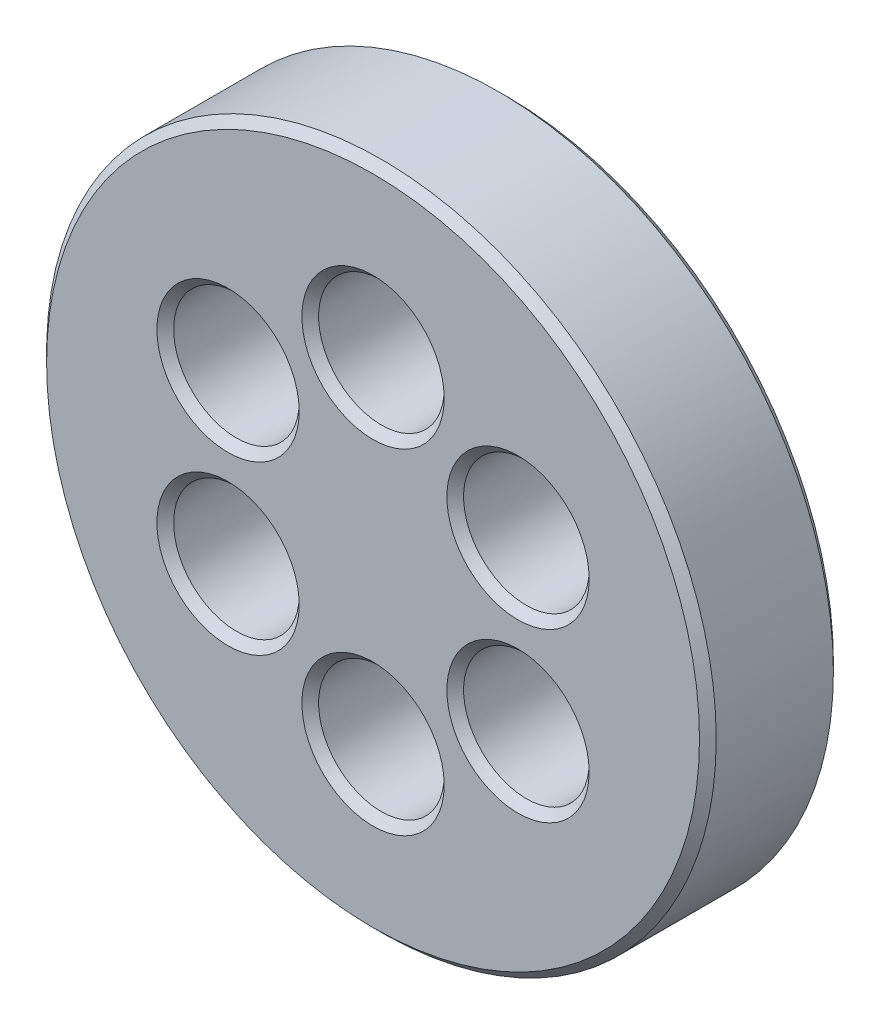
ISO-10303-21;
HEADER;
FILE_DESCRIPTION(('STEP AP214'),'2;1');
FILE_NAME('part.step','',(''),(''),'','','');
FILE_SCHEMA(('AUTOMOTIVE_DESIGN { 1 0 10303 214 1 1 1 1 }'));
ENDSEC;
DATA;
#1=APPLICATION_CONTEXT('core data for automotive mechanical design processes');
#2=APPLICATION_PROTOCOL_DEFINITION('international standard','automotive_design',2000,#1);
#3=PRODUCT_CONTEXT('',#1,'mechanical');
#4=PRODUCT('Part','Part','',(#3));
#5=PRODUCT_RELATED_PRODUCT_CATEGORY('part','',(#4));
#6=PRODUCT_DEFINITION_FORMATION('','',#4);
#7=PRODUCT_DEFINITION_CONTEXT('part definition',#1,'design');
#8=PRODUCT_DEFINITION('design','',#6,#7);
#9=PRODUCT_DEFINITION_SHAPE('','',#8);
#10=(LENGTH_UNIT() NAMED_UNIT(*) SI_UNIT(.MILLI.,.METRE.));
#11=(NAMED_UNIT(*) PLANE_ANGLE_UNIT() SI_UNIT($,.RADIAN.));
#12=(NAMED_UNIT(*) SI_UNIT($,.STERADIAN.) SOLID_ANGLE_UNIT());
#13=UNCERTAINTY_MEASURE_WITH_UNIT(LENGTH_MEASURE(1.E-05),#10,'distance_accuracy_value','');
#14=(GEOMETRIC_REPRESENTATION_CONTEXT(3) GLOBAL_UNCERTAINTY_ASSIGNED_CONTEXT((#13)) GLOBAL_UNIT_ASSIGNED_CONTEXT((#10,
#11,#12)) REPRESENTATION_CONTEXT('',''));
#15=CARTESIAN_POINT('',(0.,0.,0.));
#16=DIRECTION('',(0.,0.,1.));
#17=DIRECTION('',(1.,0.,0.));
#18=AXIS2_PLACEMENT_3D('',#15,#16,#17);
#19=CARTESIAN_POINT('',(0.,0.,8.));
#20=DIRECTION('',(0.,0.,-1.));
#21=DIRECTION('',(-1.,0.,0.));
#22=AXIS2_PLACEMENT_3D('',#19,#20,#21);
#23=CYLINDRICAL_SURFACE('',#22,20.);
#24=CARTESIAN_POINT('',(0.,0.,0.499999999999997));
#25=DIRECTION('',(0.,0.,1.));
#26=DIRECTION('',(1.,0.,0.));
#27=AXIS2_PLACEMENT_3D('',#24,#25,#26);
#28=CIRCLE('',#27,20.);
#29=CARTESIAN_POINT('',(20.,0.,0.499999999999997));
#30=VERTEX_POINT('',#29);
#31=EDGE_CURVE('E10',#30,#30,#28,.T.);
#32=ORIENTED_EDGE('',*,*,#31,.T.);
#33=EDGE_LOOP('',(#32));
#34=FACE_BOUND('',#33,.T.);
#35=CARTESIAN_POINT('',(0.,0.,7.49999999999999));
#36=DIRECTION('',(0.,0.,1.));
#37=DIRECTION('',(1.,0.,0.));
#38=AXIS2_PLACEMENT_3D('',#35,#36,#37);
#39=CIRCLE('',#38,20.);
#40=CARTESIAN_POINT('',(20.,0.,7.49999999999999));
#41=VERTEX_POINT('',#40);
#42=EDGE_CURVE('E44',#41,#41,#39,.F.);
#43=ORIENTED_EDGE('',*,*,#42,.T.);
#44=EDGE_LOOP('',(#43));
#45=FACE_BOUND('',#44,.T.);
#46=ADVANCED_FACE('F36',(#34,#45),#23,.T.);
#47=CARTESIAN_POINT('',(0.,0.,8.));
#48=DIRECTION('',(0.,0.,1.));
#49=DIRECTION('',(1.,0.,0.));
#50=AXIS2_PLACEMENT_3D('',#47,#48,#49);
#51=PLANE('',#50);
#52=CARTESIAN_POINT('',(-8.66025403784443,-4.99999999999992,8.));
#53=DIRECTION('',(0.,0.,1.));
#54=DIRECTION('',(1.,0.,0.));
#55=AXIS2_PLACEMENT_3D('',#52,#53,#54);
#56=CIRCLE('',#55,4.25000000000001);
#57=CARTESIAN_POINT('',(-4.41025403784443,-4.99999999999992,8.));
#58=VERTEX_POINT('',#57);
#59=EDGE_CURVE('E102',#58,#58,#56,.F.);
#60=ORIENTED_EDGE('',*,*,#59,.T.);
#61=EDGE_LOOP('',(#60));
#62=FACE_BOUND('',#61,.T.);
#63=CARTESIAN_POINT('',(0.,-10.,8.));
#64=DIRECTION('',(0.,0.,1.));
#65=DIRECTION('',(1.,0.,0.));
#66=AXIS2_PLACEMENT_3D('',#63,#64,#65);
#67=CIRCLE('',#66,4.25);
#68=CARTESIAN_POINT('',(4.25,-10.,8.));
#69=VERTEX_POINT('',#68);
#70=EDGE_CURVE('E105',#69,#69,#67,.F.);
#71=ORIENTED_EDGE('',*,*,#70,.T.);
#72=EDGE_LOOP('',(#71));
#73=FACE_BOUND('',#72,.T.);
#74=CARTESIAN_POINT('',(8.66025403784437,-5.00000000000004,8.));
#75=DIRECTION('',(0.,0.,1.));
#76=DIRECTION('',(1.,0.,0.));
#77=AXIS2_PLACEMENT_3D('',#74,#75,#76);
#78=CIRCLE('',#77,4.25);
#79=CARTESIAN_POINT('',(12.9102540378444,-5.00000000000004,8.));
#80=VERTEX_POINT('',#79);
#81=EDGE_CURVE('E108',#80,#80,#78,.F.);
#82=ORIENTED_EDGE('',*,*,#81,.T.);
#83=EDGE_LOOP('',(#82));
#84=FACE_BOUND('',#83,.T.);
#85=CARTESIAN_POINT('',(8.6602540378444,4.99999999999998,8.));
#86=DIRECTION('',(0.,0.,1.));
#87=DIRECTION('',(1.,0.,0.));
#88=AXIS2_PLACEMENT_3D('',#85,#86,#87);
#89=CIRCLE('',#88,4.25000000000001);
#90=CARTESIAN_POINT('',(12.9102540378444,4.99999999999998,8.));
#91=VERTEX_POINT('',#90);
#92=EDGE_CURVE('E111',#91,#91,#89,.F.);
#93=ORIENTED_EDGE('',*,*,#92,.T.);
#94=EDGE_LOOP('',(#93));
#95=FACE_BOUND('',#94,.T.);
#96=CARTESIAN_POINT('',(0.,10.,8.));
#97=DIRECTION('',(0.,0.,1.));
#98=DIRECTION('',(1.,0.,0.));
#99=AXIS2_PLACEMENT_3D('',#96,#97,#98);
#100=CIRCLE('',#99,4.25);
#101=CARTESIAN_POINT('',(4.25,10.,8.));
#102=VERTEX_POINT('',#101);
#103=EDGE_CURVE('E114',#102,#102,#100,.F.);
#104=ORIENTED_EDGE('',*,*,#103,.T.);
#105=EDGE_LOOP('',(#104));
#106=FACE_BOUND('',#105,.T.);
#107=CARTESIAN_POINT('',(-8.66025403784433,5.0000000000001,8.));
#108=DIRECTION('',(0.,0.,1.));
#109=DIRECTION('',(1.,0.,0.));
#110=AXIS2_PLACEMENT_3D('',#107,#108,#109);
#111=CIRCLE('',#110,4.25);
#112=CARTESIAN_POINT('',(-4.41025403784433,5.0000000000001,8.));
#113=VERTEX_POINT('',#112);
#114=EDGE_CURVE('E117',#113,#113,#111,.F.);
#115=ORIENTED_EDGE('',*,*,#114,.T.);
#116=EDGE_LOOP('',(#115));
#117=FACE_BOUND('',#116,.T.);
#118=CARTESIAN_POINT('',(0.,0.,8.));
#119=DIRECTION('',(0.,0.,1.));
#120=DIRECTION('',(1.,0.,0.));
#121=AXIS2_PLACEMENT_3D('',#118,#119,#120);
#122=CIRCLE('',#121,19.5);
#123=CARTESIAN_POINT('',(19.5,0.,8.));
#124=VERTEX_POINT('',#123);
#125=EDGE_CURVE('E120',#124,#124,#122,.T.);
#126=ORIENTED_EDGE('',*,*,#125,.T.);
#127=EDGE_LOOP('',(#126));
#128=FACE_BOUND('',#127,.T.);
#129=ADVANCED_FACE('F144',(#62,#73,#84,#95,#106,#117,#128),#51,.T.);
#130=CARTESIAN_POINT('',(0.,0.,0.));
#131=DIRECTION('',(0.,0.,1.));
#132=DIRECTION('',(1.,0.,0.));
#133=AXIS2_PLACEMENT_3D('',#130,#131,#132);
#134=PLANE('',#133);
#135=CARTESIAN_POINT('',(-8.66025403784443,-4.99999999999992,0.));
#136=DIRECTION('',(0.,0.,1.));
#137=DIRECTION('',(1.,0.,0.));
#138=AXIS2_PLACEMENT_3D('',#135,#136,#137);
#139=CIRCLE('',#138,4.25);
#140=CARTESIAN_POINT('',(-4.41025403784443,-4.99999999999992,0.));
#141=VERTEX_POINT('',#140);
#142=EDGE_CURVE('E81',#141,#141,#139,.T.);
#143=ORIENTED_EDGE('',*,*,#142,.T.);
#144=EDGE_LOOP('',(#143));
#145=FACE_BOUND('',#144,.T.);
#146=CARTESIAN_POINT('',(0.,-10.,0.));
#147=DIRECTION('',(0.,0.,1.));
#148=DIRECTION('',(1.,0.,0.));
#149=AXIS2_PLACEMENT_3D('',#146,#147,#148);
#150=CIRCLE('',#149,4.24999999999999);
#151=CARTESIAN_POINT('',(4.24999999999999,-10.,0.));
#152=VERTEX_POINT('',#151);
#153=EDGE_CURVE('E84',#152,#152,#150,.T.);
#154=ORIENTED_EDGE('',*,*,#153,.T.);
#155=EDGE_LOOP('',(#154));
#156=FACE_BOUND('',#155,.T.);
#157=CARTESIAN_POINT('',(8.66025403784437,-5.00000000000004,0.));
#158=DIRECTION('',(0.,0.,1.));
#159=DIRECTION('',(1.,0.,0.));
#160=AXIS2_PLACEMENT_3D('',#157,#158,#159);
#161=CIRCLE('',#160,4.25);
#162=CARTESIAN_POINT('',(12.9102540378444,-5.00000000000004,0.));
#163=VERTEX_POINT('',#162);
#164=EDGE_CURVE('E87',#163,#163,#161,.T.);
#165=ORIENTED_EDGE('',*,*,#164,.T.);
#166=EDGE_LOOP('',(#165));
#167=FACE_BOUND('',#166,.T.);
#168=CARTESIAN_POINT('',(8.6602540378444,4.99999999999998,0.));
#169=DIRECTION('',(0.,0.,1.));
#170=DIRECTION('',(1.,0.,0.));
#171=AXIS2_PLACEMENT_3D('',#168,#169,#170);
#172=CIRCLE('',#171,4.24999999999999);
#173=CARTESIAN_POINT('',(12.9102540378444,4.99999999999998,0.));
#174=VERTEX_POINT('',#173);
#175=EDGE_CURVE('E90',#174,#174,#172,.T.);
#176=ORIENTED_EDGE('',*,*,#175,.T.);
#177=EDGE_LOOP('',(#176));
#178=FACE_BOUND('',#177,.T.);
#179=CARTESIAN_POINT('',(0.,10.,0.));
#180=DIRECTION('',(0.,0.,1.));
#181=DIRECTION('',(1.,0.,0.));
#182=AXIS2_PLACEMENT_3D('',#179,#180,#181);
#183=CIRCLE('',#182,4.24999999999999);
#184=CARTESIAN_POINT('',(4.24999999999999,10.,0.));
#185=VERTEX_POINT('',#184);
#186=EDGE_CURVE('E93',#185,#185,#183,.T.);
#187=ORIENTED_EDGE('',*,*,#186,.T.);
#188=EDGE_LOOP('',(#187));
#189=FACE_BOUND('',#188,.T.);
#190=CARTESIAN_POINT('',(-8.66025403784433,5.0000000000001,0.));
#191=DIRECTION('',(0.,0.,1.));
#192=DIRECTION('',(1.,0.,0.));
#193=AXIS2_PLACEMENT_3D('',#190,#191,#192);
#194=CIRCLE('',#193,4.25);
#195=CARTESIAN_POINT('',(-4.41025403784433,5.0000000000001,0.));
#196=VERTEX_POINT('',#195);
#197=EDGE_CURVE('E96',#196,#196,#194,.T.);
#198=ORIENTED_EDGE('',*,*,#197,.T.);
#199=EDGE_LOOP('',(#198));
#200=FACE_BOUND('',#199,.T.);
#201=CARTESIAN_POINT('',(0.,0.,0.));
#202=DIRECTION('',(0.,0.,1.));
#203=DIRECTION('',(1.,0.,0.));
#204=AXIS2_PLACEMENT_3D('',#201,#202,#203);
#205=CIRCLE('',#204,19.5);
#206=CARTESIAN_POINT('',(19.5,0.,0.));
#207=VERTEX_POINT('',#206);
#208=EDGE_CURVE('E99',#207,#207,#205,.F.);
#209=ORIENTED_EDGE('',*,*,#208,.T.);
#210=EDGE_LOOP('',(#209));
#211=FACE_BOUND('',#210,.T.);
#212=ADVANCED_FACE('F140',(#145,#156,#167,#178,#189,#200,#211),#134,.F.);
#213=CARTESIAN_POINT('',(0.,10.,0.));
#214=DIRECTION('',(0.,0.,1.));
#215=DIRECTION('',(1.,0.,0.));
#216=AXIS2_PLACEMENT_3D('',#213,#214,#215);
#217=CYLINDRICAL_SURFACE('',#216,3.75);
#218=CARTESIAN_POINT('',(0.,10.,7.5));
#219=DIRECTION('',(0.,0.,1.));
#220=DIRECTION('',(1.,0.,0.));
#221=AXIS2_PLACEMENT_3D('',#218,#219,#220);
#222=CIRCLE('',#221,3.75);
#223=CARTESIAN_POINT('',(3.75,10.,7.5));
#224=VERTEX_POINT('',#223);
#225=EDGE_CURVE('E57',#224,#224,#222,.T.);
#226=ORIENTED_EDGE('',*,*,#225,.T.);
#227=EDGE_LOOP('',(#226));
#228=FACE_BOUND('',#227,.T.);
#229=CARTESIAN_POINT('',(0.,10.,0.499999999999994));
#230=DIRECTION('',(0.,0.,1.));
#231=DIRECTION('',(1.,0.,0.));
#232=AXIS2_PLACEMENT_3D('',#229,#230,#231);
#233=CIRCLE('',#232,3.75);
#234=CARTESIAN_POINT('',(3.75,10.,0.499999999999994));
#235=VERTEX_POINT('',#234);
#236=EDGE_CURVE('E60',#235,#235,#233,.F.);
#237=ORIENTED_EDGE('',*,*,#236,.T.);
#238=EDGE_LOOP('',(#237));
#239=FACE_BOUND('',#238,.T.);
#240=ADVANCED_FACE('F143',(#228,#239),#217,.F.);
#241=CARTESIAN_POINT('',(8.6602540378444,4.99999999999998,0.));
#242=DIRECTION('',(0.,0.,1.));
#243=DIRECTION('',(1.,0.,0.));
#244=AXIS2_PLACEMENT_3D('',#241,#242,#243);
#245=CYLINDRICAL_SURFACE('',#244,3.75);
#246=CARTESIAN_POINT('',(8.6602540378444,4.99999999999998,7.49999999999999));
#247=DIRECTION('',(0.,0.,1.));
#248=DIRECTION('',(1.,0.,0.));
#249=AXIS2_PLACEMENT_3D('',#246,#247,#248);
#250=CIRCLE('',#249,3.75);
#251=CARTESIAN_POINT('',(12.4102540378444,4.99999999999998,7.49999999999999));
#252=VERTEX_POINT('',#251);
#253=EDGE_CURVE('E63',#252,#252,#250,.T.);
#254=ORIENTED_EDGE('',*,*,#253,.T.);
#255=EDGE_LOOP('',(#254));
#256=FACE_BOUND('',#255,.T.);
#257=CARTESIAN_POINT('',(8.6602540378444,4.99999999999998,0.500000000000002));
#258=DIRECTION('',(0.,0.,1.));
#259=DIRECTION('',(1.,0.,0.));
#260=AXIS2_PLACEMENT_3D('',#257,#258,#259);
#261=CIRCLE('',#260,3.75);
#262=CARTESIAN_POINT('',(12.4102540378444,4.99999999999998,0.500000000000002));
#263=VERTEX_POINT('',#262);
#264=EDGE_CURVE('E66',#263,#263,#261,.F.);
#265=ORIENTED_EDGE('',*,*,#264,.T.);
#266=EDGE_LOOP('',(#265));
#267=FACE_BOUND('',#266,.T.);
#268=ADVANCED_FACE('F275',(#256,#267),#245,.F.);
#269=CARTESIAN_POINT('',(8.66025403784437,-5.00000000000004,0.));
#270=DIRECTION('',(0.,0.,1.));
#271=DIRECTION('',(1.,0.,0.));
#272=AXIS2_PLACEMENT_3D('',#269,#270,#271);
#273=CYLINDRICAL_SURFACE('',#272,3.75);
#274=CARTESIAN_POINT('',(8.66025403784437,-5.00000000000004,7.5));
#275=DIRECTION('',(0.,0.,1.));
#276=DIRECTION('',(1.,0.,0.));
#277=AXIS2_PLACEMENT_3D('',#274,#275,#276);
#278=CIRCLE('',#277,3.75);
#279=CARTESIAN_POINT('',(12.4102540378444,-5.00000000000004,7.5));
#280=VERTEX_POINT('',#279);
#281=EDGE_CURVE('E69',#280,#280,#278,.T.);
#282=ORIENTED_EDGE('',*,*,#281,.T.);
#283=EDGE_LOOP('',(#282));
#284=FACE_BOUND('',#283,.T.);
#285=CARTESIAN_POINT('',(8.66025403784437,-5.00000000000004,0.499999999999993));
#286=DIRECTION('',(0.,0.,1.));
#287=DIRECTION('',(1.,0.,0.));
#288=AXIS2_PLACEMENT_3D('',#285,#286,#287);
#289=CIRCLE('',#288,3.75);
#290=CARTESIAN_POINT('',(12.4102540378444,-5.00000000000004,0.499999999999993));
#291=VERTEX_POINT('',#290);
#292=EDGE_CURVE('E72',#291,#291,#289,.F.);
#293=ORIENTED_EDGE('',*,*,#292,.T.);
#294=EDGE_LOOP('',(#293));
#295=FACE_BOUND('',#294,.T.);
#296=ADVANCED_FACE('F278',(#284,#295),#273,.F.);
#297=CARTESIAN_POINT('',(0.,-10.,0.));
#298=DIRECTION('',(0.,0.,1.));
#299=DIRECTION('',(1.,0.,0.));
#300=AXIS2_PLACEMENT_3D('',#297,#298,#299);
#301=CYLINDRICAL_SURFACE('',#300,3.75);
#302=CARTESIAN_POINT('',(0.,-10.,7.5));
#303=DIRECTION('',(0.,0.,1.));
#304=DIRECTION('',(1.,0.,0.));
#305=AXIS2_PLACEMENT_3D('',#302,#303,#304);
#306=CIRCLE('',#305,3.75);
#307=CARTESIAN_POINT('',(3.75,-10.,7.5));
#308=VERTEX_POINT('',#307);
#309=EDGE_CURVE('E75',#308,#308,#306,.T.);
#310=ORIENTED_EDGE('',*,*,#309,.T.);
#311=EDGE_LOOP('',(#310));
#312=FACE_BOUND('',#311,.T.);
#313=CARTESIAN_POINT('',(0.,-10.,0.499999999999994));
#314=DIRECTION('',(0.,0.,1.));
#315=DIRECTION('',(1.,0.,0.));
#316=AXIS2_PLACEMENT_3D('',#313,#314,#315);
#317=CIRCLE('',#316,3.75);
#318=CARTESIAN_POINT('',(3.75,-10.,0.499999999999994));
#319=VERTEX_POINT('',#318);
#320=EDGE_CURVE('E78',#319,#319,#317,.F.);
#321=ORIENTED_EDGE('',*,*,#320,.T.);
#322=EDGE_LOOP('',(#321));
#323=FACE_BOUND('',#322,.T.);
#324=ADVANCED_FACE('F270',(#312,#323),#301,.F.);
#325=CARTESIAN_POINT('',(-8.66025403784443,-4.99999999999992,0.));
#326=DIRECTION('',(0.,0.,1.));
#327=DIRECTION('',(1.,0.,0.));
#328=AXIS2_PLACEMENT_3D('',#325,#326,#327);
#329=CYLINDRICAL_SURFACE('',#328,3.75);
#330=CARTESIAN_POINT('',(-8.66025403784443,-4.99999999999992,7.5));
#331=DIRECTION('',(0.,0.,1.));
#332=DIRECTION('',(1.,0.,0.));
#333=AXIS2_PLACEMENT_3D('',#330,#331,#332);
#334=CIRCLE('',#333,3.75);
#335=CARTESIAN_POINT('',(-4.91025403784443,-4.99999999999992,7.5));
#336=VERTEX_POINT('',#335);
#337=EDGE_CURVE('E123',#336,#336,#334,.T.);
#338=ORIENTED_EDGE('',*,*,#337,.T.);
#339=EDGE_LOOP('',(#338));
#340=FACE_BOUND('',#339,.T.);
#341=CARTESIAN_POINT('',(-8.66025403784443,-4.99999999999992,0.5));
#342=DIRECTION('',(0.,0.,1.));
#343=DIRECTION('',(1.,0.,0.));
#344=AXIS2_PLACEMENT_3D('',#341,#342,#343);
#345=CIRCLE('',#344,3.75);
#346=CARTESIAN_POINT('',(-4.91025403784443,-4.99999999999992,0.5));
#347=VERTEX_POINT('',#346);
#348=EDGE_CURVE('E126',#347,#347,#345,.F.);
#349=ORIENTED_EDGE('',*,*,#348,.T.);
#350=EDGE_LOOP('',(#349));
#351=FACE_BOUND('',#350,.T.);
#352=ADVANCED_FACE('F130',(#340,#351),#329,.F.);
#353=CARTESIAN_POINT('',(-8.66025403784433,5.0000000000001,0.));
#354=DIRECTION('',(0.,0.,1.));
#355=DIRECTION('',(1.,0.,0.));
#356=AXIS2_PLACEMENT_3D('',#353,#354,#355);
#357=CYLINDRICAL_SURFACE('',#356,3.75);
#358=CARTESIAN_POINT('',(-8.66025403784433,5.0000000000001,7.5));
#359=DIRECTION('',(0.,0.,1.));
#360=DIRECTION('',(1.,0.,0.));
#361=AXIS2_PLACEMENT_3D('',#358,#359,#360);
#362=CIRCLE('',#361,3.75);
#363=CARTESIAN_POINT('',(-4.91025403784433,5.0000000000001,7.5));
#364=VERTEX_POINT('',#363);
#365=EDGE_CURVE('E48',#364,#364,#362,.T.);
#366=ORIENTED_EDGE('',*,*,#365,.T.);
#367=EDGE_LOOP('',(#366));
#368=FACE_BOUND('',#367,.T.);
#369=CARTESIAN_POINT('',(-8.66025403784433,5.0000000000001,0.500000000000002));
#370=DIRECTION('',(0.,0.,1.));
#371=DIRECTION('',(1.,0.,0.));
#372=AXIS2_PLACEMENT_3D('',#369,#370,#371);
#373=CIRCLE('',#372,3.75);
#374=CARTESIAN_POINT('',(-4.91025403784433,5.0000000000001,0.500000000000002));
#375=VERTEX_POINT('',#374);
#376=EDGE_CURVE('E52',#375,#375,#373,.F.);
#377=ORIENTED_EDGE('',*,*,#376,.T.);
#378=EDGE_LOOP('',(#377));
#379=FACE_BOUND('',#378,.T.);
#380=ADVANCED_FACE('F184',(#368,#379),#357,.F.);
#381=CARTESIAN_POINT('',(-8.66025403784443,-4.99999999999992,7.5));
#382=DIRECTION('',(0.,0.,1.));
#383=DIRECTION('',(1.,0.,0.));
#384=AXIS2_PLACEMENT_3D('',#381,#382,#383);
#385=CONICAL_SURFACE('',#384,3.75,0.78539816339745);
#386=ORIENTED_EDGE('',*,*,#59,.F.);
#387=EDGE_LOOP('',(#386));
#388=FACE_BOUND('',#387,.T.);
#389=ORIENTED_EDGE('',*,*,#337,.F.);
#390=EDGE_LOOP('',(#389));
#391=FACE_BOUND('',#390,.T.);
#392=ADVANCED_FACE('F136',(#388,#391),#385,.F.);
#393=CARTESIAN_POINT('',(-8.66025403784443,-4.99999999999992,0.));
#394=DIRECTION('',(0.,0.,-1.));
#395=DIRECTION('',(-1.,0.,0.));
#396=AXIS2_PLACEMENT_3D('',#393,#394,#395);
#397=CONICAL_SURFACE('',#396,4.25,0.785398163397447);
#398=ORIENTED_EDGE('',*,*,#348,.F.);
#399=EDGE_LOOP('',(#398));
#400=FACE_BOUND('',#399,.T.);
#401=ORIENTED_EDGE('',*,*,#142,.F.);
#402=EDGE_LOOP('',(#401));
#403=FACE_BOUND('',#402,.T.);
#404=ADVANCED_FACE('F132',(#400,#403),#397,.F.);
#405=CARTESIAN_POINT('',(0.,-10.,7.5));
#406=DIRECTION('',(0.,0.,1.));
#407=DIRECTION('',(1.,0.,0.));
#408=AXIS2_PLACEMENT_3D('',#405,#406,#407);
#409=CONICAL_SURFACE('',#408,3.75,0.785398163397448);
#410=ORIENTED_EDGE('',*,*,#70,.F.);
#411=EDGE_LOOP('',(#410));
#412=FACE_BOUND('',#411,.T.);
#413=ORIENTED_EDGE('',*,*,#309,.F.);
#414=EDGE_LOOP('',(#413));
#415=FACE_BOUND('',#414,.T.);
#416=ADVANCED_FACE('F135',(#412,#415),#409,.F.);
#417=CARTESIAN_POINT('',(0.,-10.,0.));
#418=DIRECTION('',(0.,0.,-1.));
#419=DIRECTION('',(-1.,0.,0.));
#420=AXIS2_PLACEMENT_3D('',#417,#418,#419);
#421=CONICAL_SURFACE('',#420,4.24999999999999,0.785398163397445);
#422=ORIENTED_EDGE('',*,*,#320,.F.);
#423=EDGE_LOOP('',(#422));
#424=FACE_BOUND('',#423,.T.);
#425=ORIENTED_EDGE('',*,*,#153,.F.);
#426=EDGE_LOOP('',(#425));
#427=FACE_BOUND('',#426,.T.);
#428=ADVANCED_FACE('F195',(#424,#427),#421,.F.);
#429=CARTESIAN_POINT('',(8.66025403784437,-5.00000000000004,7.5));
#430=DIRECTION('',(0.,0.,1.));
#431=DIRECTION('',(1.,0.,0.));
#432=AXIS2_PLACEMENT_3D('',#429,#430,#431);
#433=CONICAL_SURFACE('',#432,3.75,0.78539816339744);
#434=ORIENTED_EDGE('',*,*,#81,.F.);
#435=EDGE_LOOP('',(#434));
#436=FACE_BOUND('',#435,.T.);
#437=ORIENTED_EDGE('',*,*,#281,.F.);
#438=EDGE_LOOP('',(#437));
#439=FACE_BOUND('',#438,.T.);
#440=ADVANCED_FACE('F202',(#436,#439),#433,.F.);
#441=CARTESIAN_POINT('',(8.66025403784437,-5.00000000000004,0.));
#442=DIRECTION('',(0.,0.,-1.));
#443=DIRECTION('',(-1.,0.,0.));
#444=AXIS2_PLACEMENT_3D('',#441,#442,#443);
#445=CONICAL_SURFACE('',#444,4.25,0.785398163397452);
#446=ORIENTED_EDGE('',*,*,#292,.F.);
#447=EDGE_LOOP('',(#446));
#448=FACE_BOUND('',#447,.T.);
#449=ORIENTED_EDGE('',*,*,#164,.F.);
#450=EDGE_LOOP('',(#449));
#451=FACE_BOUND('',#450,.T.);
#452=ADVANCED_FACE('F209',(#448,#451),#445,.F.);
#453=CARTESIAN_POINT('',(8.6602540378444,4.99999999999998,7.49999999999999));
#454=DIRECTION('',(0.,0.,1.));
#455=DIRECTION('',(1.,0.,0.));
#456=AXIS2_PLACEMENT_3D('',#453,#454,#455);
#457=CONICAL_SURFACE('',#456,3.75,0.785398163397451);
#458=ORIENTED_EDGE('',*,*,#92,.F.);
#459=EDGE_LOOP('',(#458));
#460=FACE_BOUND('',#459,.T.);
#461=ORIENTED_EDGE('',*,*,#253,.F.);
#462=EDGE_LOOP('',(#461));
#463=FACE_BOUND('',#462,.T.);
#464=ADVANCED_FACE('F216',(#460,#463),#457,.F.);
#465=CARTESIAN_POINT('',(8.6602540378444,4.99999999999998,0.));
#466=DIRECTION('',(0.,0.,-1.));
#467=DIRECTION('',(-1.,0.,0.));
#468=AXIS2_PLACEMENT_3D('',#465,#466,#467);
#469=CONICAL_SURFACE('',#468,4.24999999999999,0.785398163397441);
#470=ORIENTED_EDGE('',*,*,#264,.F.);
#471=EDGE_LOOP('',(#470));
#472=FACE_BOUND('',#471,.T.);
#473=ORIENTED_EDGE('',*,*,#175,.F.);
#474=EDGE_LOOP('',(#473));
#475=FACE_BOUND('',#474,.T.);
#476=ADVANCED_FACE('F223',(#472,#475),#469,.F.);
#477=CARTESIAN_POINT('',(0.,10.,7.5));
#478=DIRECTION('',(0.,0.,1.));
#479=DIRECTION('',(1.,0.,0.));
#480=AXIS2_PLACEMENT_3D('',#477,#478,#479);
#481=CONICAL_SURFACE('',#480,3.75,0.785398163397448);
#482=ORIENTED_EDGE('',*,*,#103,.F.);
#483=EDGE_LOOP('',(#482));
#484=FACE_BOUND('',#483,.T.);
#485=ORIENTED_EDGE('',*,*,#225,.F.);
#486=EDGE_LOOP('',(#485));
#487=FACE_BOUND('',#486,.T.);
#488=ADVANCED_FACE('F230',(#484,#487),#481,.F.);
#489=CARTESIAN_POINT('',(0.,10.,0.));
#490=DIRECTION('',(0.,0.,-1.));
#491=DIRECTION('',(-1.,0.,0.));
#492=AXIS2_PLACEMENT_3D('',#489,#490,#491);
#493=CONICAL_SURFACE('',#492,4.24999999999999,0.785398163397445);
#494=ORIENTED_EDGE('',*,*,#236,.F.);
#495=EDGE_LOOP('',(#494));
#496=FACE_BOUND('',#495,.T.);
#497=ORIENTED_EDGE('',*,*,#186,.F.);
#498=EDGE_LOOP('',(#497));
#499=FACE_BOUND('',#498,.T.);
#500=ADVANCED_FACE('F237',(#496,#499),#493,.F.);
#501=CARTESIAN_POINT('',(-8.66025403784433,5.0000000000001,7.5));
#502=DIRECTION('',(0.,0.,1.));
#503=DIRECTION('',(1.,0.,0.));
#504=AXIS2_PLACEMENT_3D('',#501,#502,#503);
#505=CONICAL_SURFACE('',#504,3.75,0.785398163397449);
#506=ORIENTED_EDGE('',*,*,#114,.F.);
#507=EDGE_LOOP('',(#506));
#508=FACE_BOUND('',#507,.T.);
#509=ORIENTED_EDGE('',*,*,#365,.F.);
#510=EDGE_LOOP('',(#509));
#511=FACE_BOUND('',#510,.T.);
#512=ADVANCED_FACE('F167',(#508,#511),#505,.F.);
#513=CARTESIAN_POINT('',(-8.66025403784433,5.0000000000001,0.));
#514=DIRECTION('',(0.,0.,-1.));
#515=DIRECTION('',(-1.,0.,0.));
#516=AXIS2_PLACEMENT_3D('',#513,#514,#515);
#517=CONICAL_SURFACE('',#516,4.25,0.785398163397445);
#518=ORIENTED_EDGE('',*,*,#376,.F.);
#519=EDGE_LOOP('',(#518));
#520=FACE_BOUND('',#519,.T.);
#521=ORIENTED_EDGE('',*,*,#197,.F.);
#522=EDGE_LOOP('',(#521));
#523=FACE_BOUND('',#522,.T.);
#524=ADVANCED_FACE('F161',(#520,#523),#517,.F.);
#525=CARTESIAN_POINT('',(0.,0.,0.499999999999997));
#526=DIRECTION('',(0.,0.,1.));
#527=DIRECTION('',(1.,0.,0.));
#528=AXIS2_PLACEMENT_3D('',#525,#526,#527);
#529=CONICAL_SURFACE('',#528,20.,0.785398163397445);
#530=ORIENTED_EDGE('',*,*,#208,.F.);
#531=EDGE_LOOP('',(#530));
#532=FACE_BOUND('',#531,.T.);
#533=ORIENTED_EDGE('',*,*,#31,.F.);
#534=EDGE_LOOP('',(#533));
#535=FACE_BOUND('',#534,.T.);
#536=ADVANCED_FACE('F158',(#532,#535),#529,.T.);
#537=CARTESIAN_POINT('',(0.,0.,8.));
#538=DIRECTION('',(0.,0.,-1.));
#539=DIRECTION('',(-1.,0.,0.));
#540=AXIS2_PLACEMENT_3D('',#537,#538,#539);
#541=CONICAL_SURFACE('',#540,19.5,0.785398163397448);
#542=ORIENTED_EDGE('',*,*,#42,.F.);
#543=EDGE_LOOP('',(#542));
#544=FACE_BOUND('',#543,.T.);
#545=ORIENTED_EDGE('',*,*,#125,.F.);
#546=EDGE_LOOP('',(#545));
#547=FACE_BOUND('',#546,.T.);
#548=ADVANCED_FACE('F39',(#544,#547),#541,.T.);
#549=CLOSED_SHELL('',(#46,#129,#212,#240,#268,#296,#324,#352,#380,#392,#404,#416,#428,#440,#452,
#464,#476,#488,#500,#512,#524,#536,#548));
#550=MANIFOLD_SOLID_BREP('B2',#549);
#551=ADVANCED_BREP_SHAPE_REPRESENTATION('',(#18,#550),#14);
#552=SHAPE_DEFINITION_REPRESENTATION(#9,#551);
ENDSEC;
END-ISO-10303-21;
